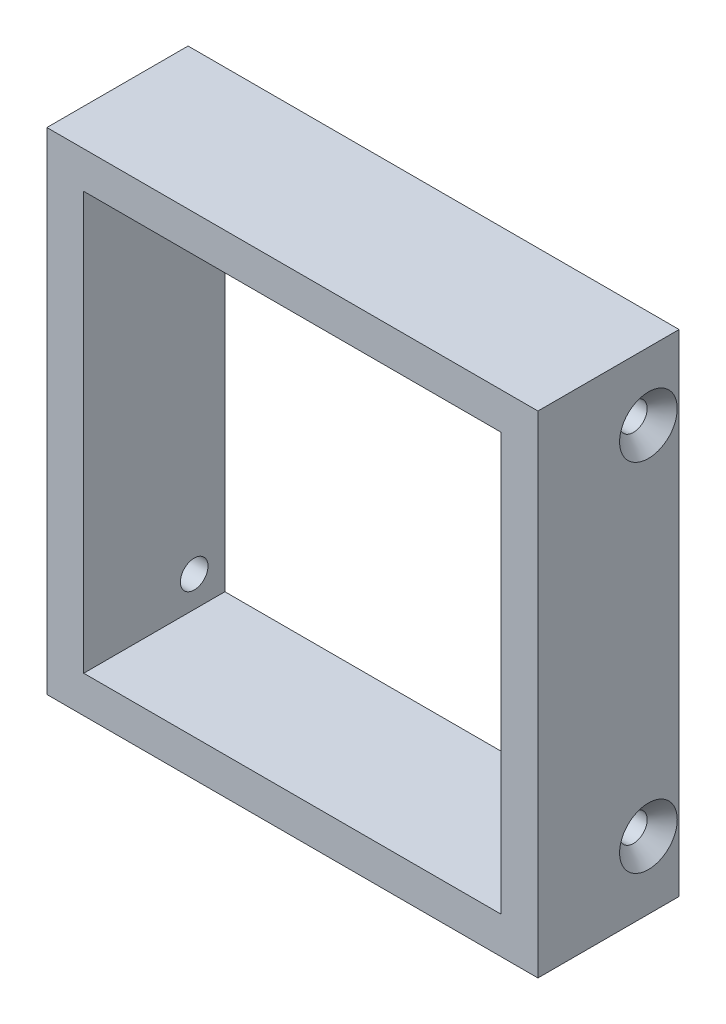
ISO-10303-21;
HEADER;
FILE_DESCRIPTION(('STEP AP214'),'2;1');
FILE_NAME('part.step','',(''),(''),'','','');
FILE_SCHEMA(('AUTOMOTIVE_DESIGN { 1 0 10303 214 1 1 1 1 }'));
ENDSEC;
DATA;
#1=APPLICATION_CONTEXT('core data for automotive mechanical design processes');
#2=APPLICATION_PROTOCOL_DEFINITION('international standard','automotive_design',2000,#1);
#3=PRODUCT_CONTEXT('',#1,'mechanical');
#4=PRODUCT('Part','Part','',(#3));
#5=PRODUCT_RELATED_PRODUCT_CATEGORY('part','',(#4));
#6=PRODUCT_DEFINITION_FORMATION('','',#4);
#7=PRODUCT_DEFINITION_CONTEXT('part definition',#1,'design');
#8=PRODUCT_DEFINITION('design','',#6,#7);
#9=PRODUCT_DEFINITION_SHAPE('','',#8);
#10=(LENGTH_UNIT() NAMED_UNIT(*) SI_UNIT(.MILLI.,.METRE.));
#11=(NAMED_UNIT(*) PLANE_ANGLE_UNIT() SI_UNIT($,.RADIAN.));
#12=(NAMED_UNIT(*) SI_UNIT($,.STERADIAN.) SOLID_ANGLE_UNIT());
#13=UNCERTAINTY_MEASURE_WITH_UNIT(LENGTH_MEASURE(1.E-05),#10,'distance_accuracy_value','');
#14=(GEOMETRIC_REPRESENTATION_CONTEXT(3) GLOBAL_UNCERTAINTY_ASSIGNED_CONTEXT((#13)) GLOBAL_UNIT_ASSIGNED_CONTEXT((#10,
#11,#12)) REPRESENTATION_CONTEXT('',''));
#15=CARTESIAN_POINT('',(0.,0.,0.));
#16=DIRECTION('',(0.,0.,1.));
#17=DIRECTION('',(1.,0.,0.));
#18=AXIS2_PLACEMENT_3D('',#15,#16,#17);
#19=CARTESIAN_POINT('',(-40.,40.,23.));
#20=DIRECTION('',(1.,0.,0.));
#21=DIRECTION('',(0.,1.,0.));
#22=AXIS2_PLACEMENT_3D('',#19,#20,#21);
#23=PLANE('',#22);
#24=CARTESIAN_POINT('',(-40.,29.,5.));
#25=DIRECTION('',(-1.,0.,0.));
#26=DIRECTION('',(0.,0.,1.));
#27=AXIS2_PLACEMENT_3D('',#24,#25,#26);
#28=CIRCLE('',#27,4.7);
#29=CARTESIAN_POINT('',(-40.,29.,9.7));
#30=VERTEX_POINT('',#29);
#31=EDGE_CURVE('E274',#30,#30,#28,.T.);
#32=ORIENTED_EDGE('',*,*,#31,.F.);
#33=EDGE_LOOP('',(#32));
#34=FACE_BOUND('',#33,.T.);
#35=DIRECTION('',(0.,-1.,0.));
#36=VECTOR('',#35,1.);
#37=CARTESIAN_POINT('',(-40.,40.,0.));
#38=LINE('',#37,#36);
#39=CARTESIAN_POINT('',(-40.,40.,0.));
#40=VERTEX_POINT('',#39);
#41=CARTESIAN_POINT('',(-40.,-40.,0.));
#42=VERTEX_POINT('',#41);
#43=EDGE_CURVE('E151',#40,#42,#38,.T.);
#44=ORIENTED_EDGE('',*,*,#43,.T.);
#45=DIRECTION('',(0.,0.,-1.));
#46=VECTOR('',#45,1.);
#47=CARTESIAN_POINT('',(-40.,-40.,23.));
#48=LINE('',#47,#46);
#49=CARTESIAN_POINT('',(-40.,-40.,23.));
#50=VERTEX_POINT('',#49);
#51=EDGE_CURVE('E156',#50,#42,#48,.T.);
#52=ORIENTED_EDGE('',*,*,#51,.F.);
#53=DIRECTION('',(0.,-1.,0.));
#54=VECTOR('',#53,1.);
#55=CARTESIAN_POINT('',(-40.,40.,23.));
#56=LINE('',#55,#54);
#57=CARTESIAN_POINT('',(-40.,40.,23.));
#58=VERTEX_POINT('',#57);
#59=EDGE_CURVE('E142',#58,#50,#56,.T.);
#60=ORIENTED_EDGE('',*,*,#59,.F.);
#61=DIRECTION('',(0.,0.,-1.));
#62=VECTOR('',#61,1.);
#63=CARTESIAN_POINT('',(-40.,40.,23.));
#64=LINE('',#63,#62);
#65=EDGE_CURVE('E40',#58,#40,#64,.T.);
#66=ORIENTED_EDGE('',*,*,#65,.T.);
#67=EDGE_LOOP('',(#44,#52,#60,#66));
#68=FACE_BOUND('',#67,.T.);
#69=CARTESIAN_POINT('',(-40.,-29.,5.));
#70=DIRECTION('',(-1.,0.,0.));
#71=DIRECTION('',(0.,0.,1.));
#72=AXIS2_PLACEMENT_3D('',#69,#70,#71);
#73=CIRCLE('',#72,4.7);
#74=CARTESIAN_POINT('',(-40.,-29.,9.7));
#75=VERTEX_POINT('',#74);
#76=EDGE_CURVE('E265',#75,#75,#73,.T.);
#77=ORIENTED_EDGE('',*,*,#76,.F.);
#78=EDGE_LOOP('',(#77));
#79=FACE_BOUND('',#78,.T.);
#80=ADVANCED_FACE('F32',(#34,#68,#79),#23,.F.);
#81=CARTESIAN_POINT('',(0.,0.,23.));
#82=DIRECTION('',(0.,0.,1.));
#83=DIRECTION('',(1.,0.,0.));
#84=AXIS2_PLACEMENT_3D('',#81,#82,#83);
#85=PLANE('',#84);
#86=DIRECTION('',(0.,1.,0.));
#87=VECTOR('',#86,1.);
#88=CARTESIAN_POINT('',(40.,40.,23.));
#89=LINE('',#88,#87);
#90=CARTESIAN_POINT('',(40.,-40.,23.));
#91=VERTEX_POINT('',#90);
#92=CARTESIAN_POINT('',(40.,40.,23.));
#93=VERTEX_POINT('',#92);
#94=EDGE_CURVE('E136',#91,#93,#89,.T.);
#95=ORIENTED_EDGE('',*,*,#94,.T.);
#96=DIRECTION('',(-1.,0.,0.));
#97=VECTOR('',#96,1.);
#98=CARTESIAN_POINT('',(-40.,40.,23.));
#99=LINE('',#98,#97);
#100=EDGE_CURVE('E139',#93,#58,#99,.T.);
#101=ORIENTED_EDGE('',*,*,#100,.T.);
#102=ORIENTED_EDGE('',*,*,#59,.T.);
#103=DIRECTION('',(1.,0.,0.));
#104=VECTOR('',#103,1.);
#105=CARTESIAN_POINT('',(-40.,-40.,23.));
#106=LINE('',#105,#104);
#107=EDGE_CURVE('E144',#50,#91,#106,.T.);
#108=ORIENTED_EDGE('',*,*,#107,.T.);
#109=EDGE_LOOP('',(#95,#101,#102,#108));
#110=FACE_BOUND('',#109,.T.);
#111=DIRECTION('',(-1.,0.,0.));
#112=VECTOR('',#111,1.);
#113=CARTESIAN_POINT('',(-34.,34.,23.));
#114=LINE('',#113,#112);
#115=CARTESIAN_POINT('',(34.,34.,23.));
#116=VERTEX_POINT('',#115);
#117=CARTESIAN_POINT('',(-34.,34.,23.));
#118=VERTEX_POINT('',#117);
#119=EDGE_CURVE('E105',#116,#118,#114,.T.);
#120=ORIENTED_EDGE('',*,*,#119,.F.);
#121=DIRECTION('',(0.,1.,0.));
#122=VECTOR('',#121,1.);
#123=CARTESIAN_POINT('',(34.,34.,23.));
#124=LINE('',#123,#122);
#125=CARTESIAN_POINT('',(34.,-34.,23.));
#126=VERTEX_POINT('',#125);
#127=EDGE_CURVE('E97',#126,#116,#124,.T.);
#128=ORIENTED_EDGE('',*,*,#127,.F.);
#129=DIRECTION('',(1.,0.,0.));
#130=VECTOR('',#129,1.);
#131=CARTESIAN_POINT('',(-34.,-34.,23.));
#132=LINE('',#131,#130);
#133=CARTESIAN_POINT('',(-34.,-34.,23.));
#134=VERTEX_POINT('',#133);
#135=EDGE_CURVE('E120',#134,#126,#132,.T.);
#136=ORIENTED_EDGE('',*,*,#135,.F.);
#137=DIRECTION('',(0.,-1.,0.));
#138=VECTOR('',#137,1.);
#139=CARTESIAN_POINT('',(-34.,34.,23.));
#140=LINE('',#139,#138);
#141=EDGE_CURVE('E118',#118,#134,#140,.T.);
#142=ORIENTED_EDGE('',*,*,#141,.F.);
#143=EDGE_LOOP('',(#120,#128,#136,#142));
#144=FACE_BOUND('',#143,.T.);
#145=ADVANCED_FACE('F117',(#110,#144),#85,.T.);
#146=CARTESIAN_POINT('',(0.,0.,0.));
#147=DIRECTION('',(0.,0.,1.));
#148=DIRECTION('',(1.,0.,0.));
#149=AXIS2_PLACEMENT_3D('',#146,#147,#148);
#150=PLANE('',#149);
#151=DIRECTION('',(0.,1.,0.));
#152=VECTOR('',#151,1.);
#153=CARTESIAN_POINT('',(40.,40.,0.));
#154=LINE('',#153,#152);
#155=CARTESIAN_POINT('',(40.,-40.,0.));
#156=VERTEX_POINT('',#155);
#157=CARTESIAN_POINT('',(40.,40.,0.));
#158=VERTEX_POINT('',#157);
#159=EDGE_CURVE('E113',#156,#158,#154,.T.);
#160=ORIENTED_EDGE('',*,*,#159,.F.);
#161=DIRECTION('',(1.,0.,0.));
#162=VECTOR('',#161,1.);
#163=CARTESIAN_POINT('',(-40.,-40.,0.));
#164=LINE('',#163,#162);
#165=EDGE_CURVE('E140',#42,#156,#164,.T.);
#166=ORIENTED_EDGE('',*,*,#165,.F.);
#167=ORIENTED_EDGE('',*,*,#43,.F.);
#168=DIRECTION('',(-1.,0.,0.));
#169=VECTOR('',#168,1.);
#170=CARTESIAN_POINT('',(-40.,40.,0.));
#171=LINE('',#170,#169);
#172=EDGE_CURVE('E149',#158,#40,#171,.T.);
#173=ORIENTED_EDGE('',*,*,#172,.F.);
#174=EDGE_LOOP('',(#160,#166,#167,#173));
#175=FACE_BOUND('',#174,.T.);
#176=DIRECTION('',(0.,1.,0.));
#177=VECTOR('',#176,1.);
#178=CARTESIAN_POINT('',(34.,34.,0.));
#179=LINE('',#178,#177);
#180=CARTESIAN_POINT('',(34.,-34.,0.));
#181=VERTEX_POINT('',#180);
#182=CARTESIAN_POINT('',(34.,34.,0.));
#183=VERTEX_POINT('',#182);
#184=EDGE_CURVE('E55',#181,#183,#179,.T.);
#185=ORIENTED_EDGE('',*,*,#184,.T.);
#186=DIRECTION('',(-1.,0.,0.));
#187=VECTOR('',#186,1.);
#188=CARTESIAN_POINT('',(-34.,34.,0.));
#189=LINE('',#188,#187);
#190=CARTESIAN_POINT('',(-34.,34.,0.));
#191=VERTEX_POINT('',#190);
#192=EDGE_CURVE('E112',#183,#191,#189,.T.);
#193=ORIENTED_EDGE('',*,*,#192,.T.);
#194=DIRECTION('',(0.,-1.,0.));
#195=VECTOR('',#194,1.);
#196=CARTESIAN_POINT('',(-34.,34.,0.));
#197=LINE('',#196,#195);
#198=CARTESIAN_POINT('',(-34.,-34.,0.));
#199=VERTEX_POINT('',#198);
#200=EDGE_CURVE('E128',#191,#199,#197,.T.);
#201=ORIENTED_EDGE('',*,*,#200,.T.);
#202=DIRECTION('',(1.,0.,0.));
#203=VECTOR('',#202,1.);
#204=CARTESIAN_POINT('',(-34.,-34.,0.));
#205=LINE('',#204,#203);
#206=EDGE_CURVE('E106',#199,#181,#205,.T.);
#207=ORIENTED_EDGE('',*,*,#206,.T.);
#208=EDGE_LOOP('',(#185,#193,#201,#207));
#209=FACE_BOUND('',#208,.T.);
#210=ADVANCED_FACE('F169',(#175,#209),#150,.F.);
#211=CARTESIAN_POINT('',(40.,40.,23.));
#212=DIRECTION('',(-1.,0.,0.));
#213=DIRECTION('',(0.,0.,1.));
#214=AXIS2_PLACEMENT_3D('',#211,#212,#213);
#215=PLANE('',#214);
#216=CARTESIAN_POINT('',(40.,29.,5.));
#217=DIRECTION('',(1.,0.,0.));
#218=DIRECTION('',(0.,0.,-1.));
#219=AXIS2_PLACEMENT_3D('',#216,#217,#218);
#220=CIRCLE('',#219,4.7);
#221=CARTESIAN_POINT('',(40.,29.,0.299999999999997));
#222=VERTEX_POINT('',#221);
#223=EDGE_CURVE('E249',#222,#222,#220,.T.);
#224=ORIENTED_EDGE('',*,*,#223,.F.);
#225=EDGE_LOOP('',(#224));
#226=FACE_BOUND('',#225,.T.);
#227=CARTESIAN_POINT('',(40.,-29.,5.));
#228=DIRECTION('',(1.,0.,0.));
#229=DIRECTION('',(0.,0.,-1.));
#230=AXIS2_PLACEMENT_3D('',#227,#228,#229);
#231=CIRCLE('',#230,4.7);
#232=CARTESIAN_POINT('',(40.,-29.,0.300000000000001));
#233=VERTEX_POINT('',#232);
#234=EDGE_CURVE('E256',#233,#233,#231,.T.);
#235=ORIENTED_EDGE('',*,*,#234,.F.);
#236=EDGE_LOOP('',(#235));
#237=FACE_BOUND('',#236,.T.);
#238=ORIENTED_EDGE('',*,*,#159,.T.);
#239=DIRECTION('',(0.,0.,-1.));
#240=VECTOR('',#239,1.);
#241=CARTESIAN_POINT('',(40.,40.,23.));
#242=LINE('',#241,#240);
#243=EDGE_CURVE('E11',#93,#158,#242,.T.);
#244=ORIENTED_EDGE('',*,*,#243,.F.);
#245=ORIENTED_EDGE('',*,*,#94,.F.);
#246=DIRECTION('',(0.,0.,-1.));
#247=VECTOR('',#246,1.);
#248=CARTESIAN_POINT('',(40.,-40.,23.));
#249=LINE('',#248,#247);
#250=EDGE_CURVE('E146',#91,#156,#249,.T.);
#251=ORIENTED_EDGE('',*,*,#250,.T.);
#252=EDGE_LOOP('',(#238,#244,#245,#251));
#253=FACE_BOUND('',#252,.T.);
#254=ADVANCED_FACE('F34',(#226,#237,#253),#215,.F.);
#255=CARTESIAN_POINT('',(-40.,40.,23.));
#256=DIRECTION('',(0.,-1.,0.));
#257=DIRECTION('',(0.,0.,-1.));
#258=AXIS2_PLACEMENT_3D('',#255,#256,#257);
#259=PLANE('',#258);
#260=ORIENTED_EDGE('',*,*,#172,.T.);
#261=ORIENTED_EDGE('',*,*,#65,.F.);
#262=ORIENTED_EDGE('',*,*,#100,.F.);
#263=ORIENTED_EDGE('',*,*,#243,.T.);
#264=EDGE_LOOP('',(#260,#261,#262,#263));
#265=FACE_BOUND('',#264,.T.);
#266=ADVANCED_FACE('F179',(#265),#259,.F.);
#267=CARTESIAN_POINT('',(-40.,-40.,23.));
#268=DIRECTION('',(0.,1.,0.));
#269=DIRECTION('',(0.,0.,1.));
#270=AXIS2_PLACEMENT_3D('',#267,#268,#269);
#271=PLANE('',#270);
#272=ORIENTED_EDGE('',*,*,#165,.T.);
#273=ORIENTED_EDGE('',*,*,#250,.F.);
#274=ORIENTED_EDGE('',*,*,#107,.F.);
#275=ORIENTED_EDGE('',*,*,#51,.T.);
#276=EDGE_LOOP('',(#272,#273,#274,#275));
#277=FACE_BOUND('',#276,.T.);
#278=ADVANCED_FACE('F173',(#277),#271,.F.);
#279=CARTESIAN_POINT('',(34.,34.,23.));
#280=DIRECTION('',(-1.,0.,0.));
#281=DIRECTION('',(0.,-1.,0.));
#282=AXIS2_PLACEMENT_3D('',#279,#280,#281);
#283=PLANE('',#282);
#284=CARTESIAN_POINT('',(34.,29.,5.));
#285=DIRECTION('',(-1.,0.,0.));
#286=DIRECTION('',(0.,-1.,0.));
#287=AXIS2_PLACEMENT_3D('',#284,#285,#286);
#288=CIRCLE('',#287,2.25);
#289=CARTESIAN_POINT('',(34.,26.75,5.));
#290=VERTEX_POINT('',#289);
#291=EDGE_CURVE('E251',#290,#290,#288,.T.);
#292=ORIENTED_EDGE('',*,*,#291,.F.);
#293=EDGE_LOOP('',(#292));
#294=FACE_BOUND('',#293,.T.);
#295=CARTESIAN_POINT('',(34.,-29.,5.));
#296=DIRECTION('',(-1.,0.,0.));
#297=DIRECTION('',(0.,-1.,0.));
#298=AXIS2_PLACEMENT_3D('',#295,#296,#297);
#299=CIRCLE('',#298,2.24999999999999);
#300=CARTESIAN_POINT('',(34.,-31.25,5.));
#301=VERTEX_POINT('',#300);
#302=EDGE_CURVE('E262',#301,#301,#299,.T.);
#303=ORIENTED_EDGE('',*,*,#302,.F.);
#304=EDGE_LOOP('',(#303));
#305=FACE_BOUND('',#304,.T.);
#306=ORIENTED_EDGE('',*,*,#184,.F.);
#307=DIRECTION('',(0.,0.,-1.));
#308=VECTOR('',#307,1.);
#309=CARTESIAN_POINT('',(34.,-34.,23.));
#310=LINE('',#309,#308);
#311=EDGE_CURVE('E101',#126,#181,#310,.T.);
#312=ORIENTED_EDGE('',*,*,#311,.F.);
#313=ORIENTED_EDGE('',*,*,#127,.T.);
#314=DIRECTION('',(0.,0.,-1.));
#315=VECTOR('',#314,1.);
#316=CARTESIAN_POINT('',(34.,34.,23.));
#317=LINE('',#316,#315);
#318=EDGE_CURVE('E100',#116,#183,#317,.T.);
#319=ORIENTED_EDGE('',*,*,#318,.T.);
#320=EDGE_LOOP('',(#306,#312,#313,#319));
#321=FACE_BOUND('',#320,.T.);
#322=ADVANCED_FACE('F99',(#294,#305,#321),#283,.T.);
#323=CARTESIAN_POINT('',(-34.,34.,23.));
#324=DIRECTION('',(0.,-1.,0.));
#325=DIRECTION('',(0.,0.,-1.));
#326=AXIS2_PLACEMENT_3D('',#323,#324,#325);
#327=PLANE('',#326);
#328=ORIENTED_EDGE('',*,*,#192,.F.);
#329=ORIENTED_EDGE('',*,*,#318,.F.);
#330=ORIENTED_EDGE('',*,*,#119,.T.);
#331=DIRECTION('',(0.,0.,-1.));
#332=VECTOR('',#331,1.);
#333=CARTESIAN_POINT('',(-34.,34.,23.));
#334=LINE('',#333,#332);
#335=EDGE_CURVE('E114',#118,#191,#334,.T.);
#336=ORIENTED_EDGE('',*,*,#335,.T.);
#337=EDGE_LOOP('',(#328,#329,#330,#336));
#338=FACE_BOUND('',#337,.T.);
#339=ADVANCED_FACE('F109',(#338),#327,.T.);
#340=CARTESIAN_POINT('',(-34.,34.,23.));
#341=DIRECTION('',(1.,0.,0.));
#342=DIRECTION('',(0.,1.,0.));
#343=AXIS2_PLACEMENT_3D('',#340,#341,#342);
#344=PLANE('',#343);
#345=CARTESIAN_POINT('',(-34.,-29.,5.));
#346=DIRECTION('',(1.,0.,0.));
#347=DIRECTION('',(0.,1.,0.));
#348=AXIS2_PLACEMENT_3D('',#345,#346,#347);
#349=CIRCLE('',#348,2.24999999999999);
#350=CARTESIAN_POINT('',(-34.,-26.75,5.));
#351=VERTEX_POINT('',#350);
#352=EDGE_CURVE('E271',#351,#351,#349,.T.);
#353=ORIENTED_EDGE('',*,*,#352,.F.);
#354=EDGE_LOOP('',(#353));
#355=FACE_BOUND('',#354,.T.);
#356=CARTESIAN_POINT('',(-34.,29.,5.));
#357=DIRECTION('',(1.,0.,0.));
#358=DIRECTION('',(0.,1.,0.));
#359=AXIS2_PLACEMENT_3D('',#356,#357,#358);
#360=CIRCLE('',#359,2.25);
#361=CARTESIAN_POINT('',(-34.,31.25,5.));
#362=VERTEX_POINT('',#361);
#363=EDGE_CURVE('E126',#362,#362,#360,.T.);
#364=ORIENTED_EDGE('',*,*,#363,.F.);
#365=EDGE_LOOP('',(#364));
#366=FACE_BOUND('',#365,.T.);
#367=ORIENTED_EDGE('',*,*,#200,.F.);
#368=ORIENTED_EDGE('',*,*,#335,.F.);
#369=ORIENTED_EDGE('',*,*,#141,.T.);
#370=DIRECTION('',(0.,0.,-1.));
#371=VECTOR('',#370,1.);
#372=CARTESIAN_POINT('',(-34.,-34.,23.));
#373=LINE('',#372,#371);
#374=EDGE_CURVE('E47',#134,#199,#373,.T.);
#375=ORIENTED_EDGE('',*,*,#374,.T.);
#376=EDGE_LOOP('',(#367,#368,#369,#375));
#377=FACE_BOUND('',#376,.T.);
#378=ADVANCED_FACE('F203',(#355,#366,#377),#344,.T.);
#379=CARTESIAN_POINT('',(-34.,-34.,23.));
#380=DIRECTION('',(0.,1.,0.));
#381=DIRECTION('',(0.,0.,1.));
#382=AXIS2_PLACEMENT_3D('',#379,#380,#381);
#383=PLANE('',#382);
#384=ORIENTED_EDGE('',*,*,#206,.F.);
#385=ORIENTED_EDGE('',*,*,#374,.F.);
#386=ORIENTED_EDGE('',*,*,#135,.T.);
#387=ORIENTED_EDGE('',*,*,#311,.T.);
#388=EDGE_LOOP('',(#384,#385,#386,#387));
#389=FACE_BOUND('',#388,.T.);
#390=ADVANCED_FACE('F206',(#389),#383,.T.);
#391=CARTESIAN_POINT('',(-40.,29.,5.));
#392=DIRECTION('',(-1.,0.,0.));
#393=DIRECTION('',(0.,0.,1.));
#394=AXIS2_PLACEMENT_3D('',#391,#392,#393);
#395=CYLINDRICAL_SURFACE('',#394,2.25);
#396=CARTESIAN_POINT('',(-37.55,29.,5.));
#397=DIRECTION('',(-1.,0.,0.));
#398=DIRECTION('',(0.,0.,1.));
#399=AXIS2_PLACEMENT_3D('',#396,#397,#398);
#400=CIRCLE('',#399,2.25);
#401=CARTESIAN_POINT('',(-37.55,29.,7.25));
#402=VERTEX_POINT('',#401);
#403=EDGE_CURVE('E277',#402,#402,#400,.T.);
#404=ORIENTED_EDGE('',*,*,#403,.T.);
#405=EDGE_LOOP('',(#404));
#406=FACE_BOUND('',#405,.T.);
#407=ORIENTED_EDGE('',*,*,#363,.T.);
#408=EDGE_LOOP('',(#407));
#409=FACE_BOUND('',#408,.T.);
#410=ADVANCED_FACE('F210',(#406,#409),#395,.F.);
#411=CARTESIAN_POINT('',(-40.,29.,5.));
#412=DIRECTION('',(-1.,0.,0.));
#413=DIRECTION('',(0.,0.,1.));
#414=AXIS2_PLACEMENT_3D('',#411,#412,#413);
#415=CONICAL_SURFACE('',#414,4.7,0.785398163397448);
#416=ORIENTED_EDGE('',*,*,#403,.F.);
#417=EDGE_LOOP('',(#416));
#418=FACE_BOUND('',#417,.T.);
#419=ORIENTED_EDGE('',*,*,#31,.T.);
#420=EDGE_LOOP('',(#419));
#421=FACE_BOUND('',#420,.T.);
#422=ADVANCED_FACE('F213',(#418,#421),#415,.F.);
#423=CARTESIAN_POINT('',(-40.,-29.,5.));
#424=DIRECTION('',(-1.,0.,0.));
#425=DIRECTION('',(0.,0.,1.));
#426=AXIS2_PLACEMENT_3D('',#423,#424,#425);
#427=CYLINDRICAL_SURFACE('',#426,2.24999999999999);
#428=CARTESIAN_POINT('',(-37.55,-29.,5.));
#429=DIRECTION('',(-1.,0.,0.));
#430=DIRECTION('',(0.,0.,1.));
#431=AXIS2_PLACEMENT_3D('',#428,#429,#430);
#432=CIRCLE('',#431,2.25);
#433=CARTESIAN_POINT('',(-37.55,-29.,7.25));
#434=VERTEX_POINT('',#433);
#435=EDGE_CURVE('E268',#434,#434,#432,.T.);
#436=ORIENTED_EDGE('',*,*,#435,.T.);
#437=EDGE_LOOP('',(#436));
#438=FACE_BOUND('',#437,.T.);
#439=ORIENTED_EDGE('',*,*,#352,.T.);
#440=EDGE_LOOP('',(#439));
#441=FACE_BOUND('',#440,.T.);
#442=ADVANCED_FACE('F217',(#438,#441),#427,.F.);
#443=CARTESIAN_POINT('',(-40.,-29.,5.));
#444=DIRECTION('',(-1.,0.,0.));
#445=DIRECTION('',(0.,0.,1.));
#446=AXIS2_PLACEMENT_3D('',#443,#444,#445);
#447=CONICAL_SURFACE('',#446,4.7,0.785398163397448);
#448=ORIENTED_EDGE('',*,*,#435,.F.);
#449=EDGE_LOOP('',(#448));
#450=FACE_BOUND('',#449,.T.);
#451=ORIENTED_EDGE('',*,*,#76,.T.);
#452=EDGE_LOOP('',(#451));
#453=FACE_BOUND('',#452,.T.);
#454=ADVANCED_FACE('F221',(#450,#453),#447,.F.);
#455=CARTESIAN_POINT('',(40.,-29.,5.));
#456=DIRECTION('',(1.,0.,0.));
#457=DIRECTION('',(0.,0.,-1.));
#458=AXIS2_PLACEMENT_3D('',#455,#456,#457);
#459=CYLINDRICAL_SURFACE('',#458,2.24999999999999);
#460=CARTESIAN_POINT('',(37.55,-29.,5.));
#461=DIRECTION('',(1.,0.,0.));
#462=DIRECTION('',(0.,0.,-1.));
#463=AXIS2_PLACEMENT_3D('',#460,#461,#462);
#464=CIRCLE('',#463,2.25);
#465=CARTESIAN_POINT('',(37.55,-29.,2.75));
#466=VERTEX_POINT('',#465);
#467=EDGE_CURVE('E259',#466,#466,#464,.T.);
#468=ORIENTED_EDGE('',*,*,#467,.T.);
#469=EDGE_LOOP('',(#468));
#470=FACE_BOUND('',#469,.T.);
#471=ORIENTED_EDGE('',*,*,#302,.T.);
#472=EDGE_LOOP('',(#471));
#473=FACE_BOUND('',#472,.T.);
#474=ADVANCED_FACE('F225',(#470,#473),#459,.F.);
#475=CARTESIAN_POINT('',(40.,-29.,5.));
#476=DIRECTION('',(1.,0.,0.));
#477=DIRECTION('',(0.,0.,-1.));
#478=AXIS2_PLACEMENT_3D('',#475,#476,#477);
#479=CONICAL_SURFACE('',#478,4.7,0.785398163397448);
#480=ORIENTED_EDGE('',*,*,#467,.F.);
#481=EDGE_LOOP('',(#480));
#482=FACE_BOUND('',#481,.T.);
#483=ORIENTED_EDGE('',*,*,#234,.T.);
#484=EDGE_LOOP('',(#483));
#485=FACE_BOUND('',#484,.T.);
#486=ADVANCED_FACE('F229',(#482,#485),#479,.F.);
#487=CARTESIAN_POINT('',(40.,29.,5.));
#488=DIRECTION('',(1.,0.,0.));
#489=DIRECTION('',(0.,0.,-1.));
#490=AXIS2_PLACEMENT_3D('',#487,#488,#489);
#491=CYLINDRICAL_SURFACE('',#490,2.25);
#492=CARTESIAN_POINT('',(37.55,29.,5.));
#493=DIRECTION('',(1.,0.,0.));
#494=DIRECTION('',(0.,0.,-1.));
#495=AXIS2_PLACEMENT_3D('',#492,#493,#494);
#496=CIRCLE('',#495,2.25);
#497=CARTESIAN_POINT('',(37.55,29.,2.75));
#498=VERTEX_POINT('',#497);
#499=EDGE_CURVE('E246',#498,#498,#496,.T.);
#500=ORIENTED_EDGE('',*,*,#499,.T.);
#501=EDGE_LOOP('',(#500));
#502=FACE_BOUND('',#501,.T.);
#503=ORIENTED_EDGE('',*,*,#291,.T.);
#504=EDGE_LOOP('',(#503));
#505=FACE_BOUND('',#504,.T.);
#506=ADVANCED_FACE('F233',(#502,#505),#491,.F.);
#507=CARTESIAN_POINT('',(40.,29.,5.));
#508=DIRECTION('',(1.,0.,0.));
#509=DIRECTION('',(0.,0.,-1.));
#510=AXIS2_PLACEMENT_3D('',#507,#508,#509);
#511=CONICAL_SURFACE('',#510,4.7,0.785398163397448);
#512=ORIENTED_EDGE('',*,*,#499,.F.);
#513=EDGE_LOOP('',(#512));
#514=FACE_BOUND('',#513,.T.);
#515=ORIENTED_EDGE('',*,*,#223,.T.);
#516=EDGE_LOOP('',(#515));
#517=FACE_BOUND('',#516,.T.);
#518=ADVANCED_FACE('F237',(#514,#517),#511,.F.);
#519=CLOSED_SHELL('',(#80,#145,#210,#254,#266,#278,#322,#339,#378,#390,#410,#422,#442,#454,#474,
#486,#506,#518));
#520=MANIFOLD_SOLID_BREP('B2',#519);
#521=ADVANCED_BREP_SHAPE_REPRESENTATION('',(#18,#520),#14);
#522=SHAPE_DEFINITION_REPRESENTATION(#9,#521);
ENDSEC;
END-ISO-10303-21;
